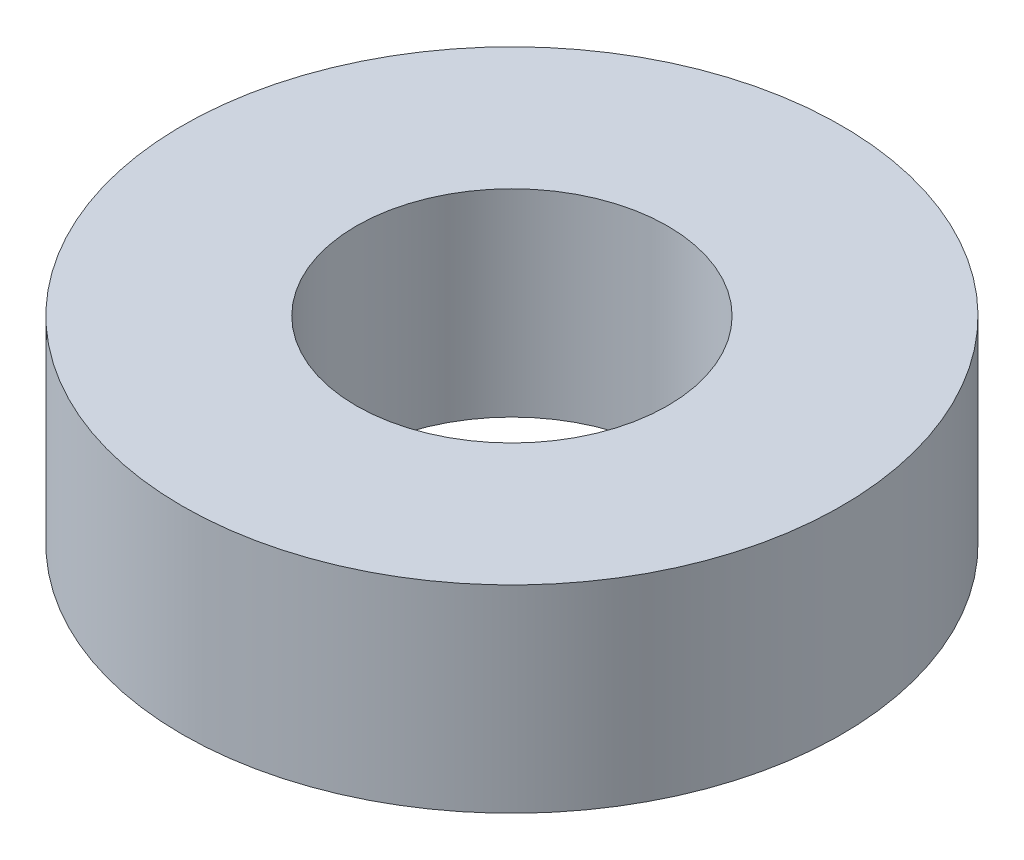
ISO-10303-21;
HEADER;
FILE_DESCRIPTION(('STEP AP214'),'2;1');
FILE_NAME('part.step','',(''),(''),'','','');
FILE_SCHEMA(('AUTOMOTIVE_DESIGN { 1 0 10303 214 1 1 1 1 }'));
ENDSEC;
DATA;
#1=APPLICATION_CONTEXT('core data for automotive mechanical design processes');
#2=APPLICATION_PROTOCOL_DEFINITION('international standard','automotive_design',2000,#1);
#3=PRODUCT_CONTEXT('',#1,'mechanical');
#4=PRODUCT('Part','Part','',(#3));
#5=PRODUCT_RELATED_PRODUCT_CATEGORY('part','',(#4));
#6=PRODUCT_DEFINITION_FORMATION('','',#4);
#7=PRODUCT_DEFINITION_CONTEXT('part definition',#1,'design');
#8=PRODUCT_DEFINITION('design','',#6,#7);
#9=PRODUCT_DEFINITION_SHAPE('','',#8);
#10=(LENGTH_UNIT() NAMED_UNIT(*) SI_UNIT(.MILLI.,.METRE.));
#11=(NAMED_UNIT(*) PLANE_ANGLE_UNIT() SI_UNIT($,.RADIAN.));
#12=(NAMED_UNIT(*) SI_UNIT($,.STERADIAN.) SOLID_ANGLE_UNIT());
#13=UNCERTAINTY_MEASURE_WITH_UNIT(LENGTH_MEASURE(1.E-05),#10,'distance_accuracy_value','');
#14=(GEOMETRIC_REPRESENTATION_CONTEXT(3) GLOBAL_UNCERTAINTY_ASSIGNED_CONTEXT((#13)) GLOBAL_UNIT_ASSIGNED_CONTEXT((#10,
#11,#12)) REPRESENTATION_CONTEXT('',''));
#15=CARTESIAN_POINT('',(0.,0.,0.));
#16=DIRECTION('',(0.,0.,1.));
#17=DIRECTION('',(1.,0.,0.));
#18=AXIS2_PLACEMENT_3D('',#15,#16,#17);
#19=CARTESIAN_POINT('',(0.,3.81,0.));
#20=DIRECTION('',(0.,1.,0.));
#21=DIRECTION('',(0.,0.,1.));
#22=AXIS2_PLACEMENT_3D('',#19,#20,#21);
#23=PLANE('',#22);
#24=CARTESIAN_POINT('',(0.,3.81,0.));
#25=DIRECTION('',(0.,1.,0.));
#26=DIRECTION('',(0.,0.,1.));
#27=AXIS2_PLACEMENT_3D('',#24,#25,#26);
#28=CIRCLE('',#27,6.35);
#29=CARTESIAN_POINT('',(0.,3.81,6.35));
#30=VERTEX_POINT('',#29);
#31=EDGE_CURVE('E10',#30,#30,#28,.T.);
#32=ORIENTED_EDGE('',*,*,#31,.T.);
#33=EDGE_LOOP('',(#32));
#34=FACE_BOUND('',#33,.T.);
#35=CARTESIAN_POINT('',(0.,3.81,0.));
#36=DIRECTION('',(0.,1.,0.));
#37=DIRECTION('',(0.,0.,1.));
#38=AXIS2_PLACEMENT_3D('',#35,#36,#37);
#39=CIRCLE('',#38,3.);
#40=CARTESIAN_POINT('',(0.,3.81,3.));
#41=VERTEX_POINT('',#40);
#42=EDGE_CURVE('E42',#41,#41,#39,.T.);
#43=ORIENTED_EDGE('',*,*,#42,.F.);
#44=EDGE_LOOP('',(#43));
#45=FACE_BOUND('',#44,.T.);
#46=ADVANCED_FACE('F31',(#34,#45),#23,.T.);
#47=CARTESIAN_POINT('',(0.,0.,0.));
#48=DIRECTION('',(0.,1.,0.));
#49=DIRECTION('',(0.,0.,1.));
#50=AXIS2_PLACEMENT_3D('',#47,#48,#49);
#51=PLANE('',#50);
#52=CARTESIAN_POINT('',(0.,0.,0.));
#53=DIRECTION('',(0.,1.,0.));
#54=DIRECTION('',(0.,0.,1.));
#55=AXIS2_PLACEMENT_3D('',#52,#53,#54);
#56=CIRCLE('',#55,6.35);
#57=CARTESIAN_POINT('',(0.,0.,6.35));
#58=VERTEX_POINT('',#57);
#59=EDGE_CURVE('E35',#58,#58,#56,.T.);
#60=ORIENTED_EDGE('',*,*,#59,.F.);
#61=EDGE_LOOP('',(#60));
#62=FACE_BOUND('',#61,.T.);
#63=CARTESIAN_POINT('',(0.,0.,0.));
#64=DIRECTION('',(0.,1.,0.));
#65=DIRECTION('',(0.,0.,1.));
#66=AXIS2_PLACEMENT_3D('',#63,#64,#65);
#67=CIRCLE('',#66,3.);
#68=CARTESIAN_POINT('',(0.,0.,3.));
#69=VERTEX_POINT('',#68);
#70=EDGE_CURVE('E44',#69,#69,#67,.T.);
#71=ORIENTED_EDGE('',*,*,#70,.T.);
#72=EDGE_LOOP('',(#71));
#73=FACE_BOUND('',#72,.T.);
#74=ADVANCED_FACE('F54',(#62,#73),#51,.F.);
#75=CARTESIAN_POINT('',(0.,3.81,0.));
#76=DIRECTION('',(0.,-1.,0.));
#77=DIRECTION('',(0.,0.,-1.));
#78=AXIS2_PLACEMENT_3D('',#75,#76,#77);
#79=CYLINDRICAL_SURFACE('',#78,6.35);
#80=ORIENTED_EDGE('',*,*,#31,.F.);
#81=EDGE_LOOP('',(#80));
#82=FACE_BOUND('',#81,.T.);
#83=ORIENTED_EDGE('',*,*,#59,.T.);
#84=EDGE_LOOP('',(#83));
#85=FACE_BOUND('',#84,.T.);
#86=ADVANCED_FACE('F33',(#82,#85),#79,.T.);
#87=CARTESIAN_POINT('',(0.,3.81,0.));
#88=DIRECTION('',(0.,-1.,0.));
#89=DIRECTION('',(0.,0.,-1.));
#90=AXIS2_PLACEMENT_3D('',#87,#88,#89);
#91=CYLINDRICAL_SURFACE('',#90,3.);
#92=ORIENTED_EDGE('',*,*,#42,.T.);
#93=EDGE_LOOP('',(#92));
#94=FACE_BOUND('',#93,.T.);
#95=ORIENTED_EDGE('',*,*,#70,.F.);
#96=EDGE_LOOP('',(#95));
#97=FACE_BOUND('',#96,.T.);
#98=ADVANCED_FACE('F50',(#94,#97),#91,.F.);
#99=CLOSED_SHELL('',(#46,#74,#86,#98));
#100=MANIFOLD_SOLID_BREP('B2',#99);
#101=ADVANCED_BREP_SHAPE_REPRESENTATION('',(#18,#100),#14);
#102=SHAPE_DEFINITION_REPRESENTATION(#9,#101);
ENDSEC;
END-ISO-10303-21;
